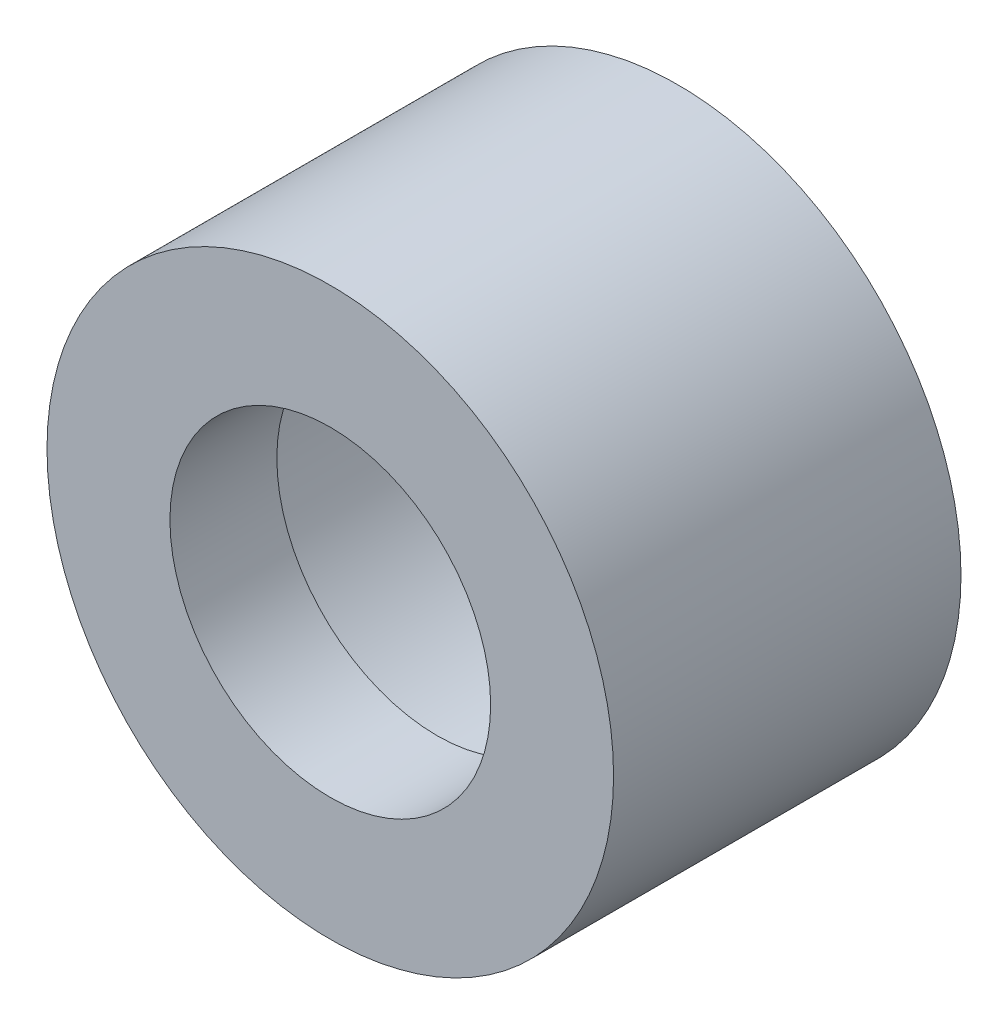
ISO-10303-21;
HEADER;
FILE_DESCRIPTION(('STEP AP214'),'2;1');
FILE_NAME('part.step','',(''),(''),'','','');
FILE_SCHEMA(('AUTOMOTIVE_DESIGN { 1 0 10303 214 1 1 1 1 }'));
ENDSEC;
DATA;
#1=APPLICATION_CONTEXT('core data for automotive mechanical design processes');
#2=APPLICATION_PROTOCOL_DEFINITION('international standard','automotive_design',2000,#1);
#3=PRODUCT_CONTEXT('',#1,'mechanical');
#4=PRODUCT('Part','Part','',(#3));
#5=PRODUCT_RELATED_PRODUCT_CATEGORY('part','',(#4));
#6=PRODUCT_DEFINITION_FORMATION('','',#4);
#7=PRODUCT_DEFINITION_CONTEXT('part definition',#1,'design');
#8=PRODUCT_DEFINITION('design','',#6,#7);
#9=PRODUCT_DEFINITION_SHAPE('','',#8);
#10=(LENGTH_UNIT() NAMED_UNIT(*) SI_UNIT(.MILLI.,.METRE.));
#11=(NAMED_UNIT(*) PLANE_ANGLE_UNIT() SI_UNIT($,.RADIAN.));
#12=(NAMED_UNIT(*) SI_UNIT($,.STERADIAN.) SOLID_ANGLE_UNIT());
#13=UNCERTAINTY_MEASURE_WITH_UNIT(LENGTH_MEASURE(1.E-05),#10,'distance_accuracy_value','');
#14=(GEOMETRIC_REPRESENTATION_CONTEXT(3) GLOBAL_UNCERTAINTY_ASSIGNED_CONTEXT((#13)) GLOBAL_UNIT_ASSIGNED_CONTEXT((#10,
#11,#12)) REPRESENTATION_CONTEXT('',''));
#15=CARTESIAN_POINT('',(0.,0.,0.));
#16=DIRECTION('',(0.,0.,1.));
#17=DIRECTION('',(1.,0.,0.));
#18=AXIS2_PLACEMENT_3D('',#15,#16,#17);
#19=CARTESIAN_POINT('',(0.,0.,16.51));
#20=DIRECTION('',(0.,0.,-1.));
#21=DIRECTION('',(-1.,0.,0.));
#22=AXIS2_PLACEMENT_3D('',#19,#20,#21);
#23=CYLINDRICAL_SURFACE('',#22,13.462);
#24=CARTESIAN_POINT('',(0.,0.,16.51));
#25=DIRECTION('',(0.,0.,1.));
#26=DIRECTION('',(1.,0.,0.));
#27=AXIS2_PLACEMENT_3D('',#24,#25,#26);
#28=CIRCLE('',#27,13.462);
#29=CARTESIAN_POINT('',(13.462,0.,16.51));
#30=VERTEX_POINT('',#29);
#31=EDGE_CURVE('E10',#30,#30,#28,.T.);
#32=ORIENTED_EDGE('',*,*,#31,.F.);
#33=EDGE_LOOP('',(#32));
#34=FACE_BOUND('',#33,.T.);
#35=CARTESIAN_POINT('',(0.,0.,0.));
#36=DIRECTION('',(0.,0.,1.));
#37=DIRECTION('',(1.,0.,0.));
#38=AXIS2_PLACEMENT_3D('',#35,#36,#37);
#39=CIRCLE('',#38,13.462);
#40=CARTESIAN_POINT('',(13.462,0.,0.));
#41=VERTEX_POINT('',#40);
#42=EDGE_CURVE('E40',#41,#41,#39,.T.);
#43=ORIENTED_EDGE('',*,*,#42,.T.);
#44=EDGE_LOOP('',(#43));
#45=FACE_BOUND('',#44,.T.);
#46=ADVANCED_FACE('F37',(#34,#45),#23,.T.);
#47=CARTESIAN_POINT('',(0.,0.,16.51));
#48=DIRECTION('',(0.,0.,1.));
#49=DIRECTION('',(1.,0.,0.));
#50=AXIS2_PLACEMENT_3D('',#47,#48,#49);
#51=PLANE('',#50);
#52=CARTESIAN_POINT('',(0.,0.,16.51));
#53=DIRECTION('',(0.,0.,1.));
#54=DIRECTION('',(1.,0.,0.));
#55=AXIS2_PLACEMENT_3D('',#52,#53,#54);
#56=CIRCLE('',#55,7.62);
#57=CARTESIAN_POINT('',(7.62,0.,16.51));
#58=VERTEX_POINT('',#57);
#59=EDGE_CURVE('E49',#58,#58,#56,.T.);
#60=ORIENTED_EDGE('',*,*,#59,.F.);
#61=EDGE_LOOP('',(#60));
#62=FACE_BOUND('',#61,.T.);
#63=ORIENTED_EDGE('',*,*,#31,.T.);
#64=EDGE_LOOP('',(#63));
#65=FACE_BOUND('',#64,.T.);
#66=ADVANCED_FACE('F78',(#62,#65),#51,.T.);
#67=CARTESIAN_POINT('',(0.,0.,0.));
#68=DIRECTION('',(0.,0.,1.));
#69=DIRECTION('',(1.,0.,0.));
#70=AXIS2_PLACEMENT_3D('',#67,#68,#69);
#71=PLANE('',#70);
#72=CARTESIAN_POINT('',(0.,0.,0.));
#73=DIRECTION('',(0.,0.,1.));
#74=DIRECTION('',(1.,0.,0.));
#75=AXIS2_PLACEMENT_3D('',#72,#73,#74);
#76=CIRCLE('',#75,10.414);
#77=CARTESIAN_POINT('',(10.414,0.,0.));
#78=VERTEX_POINT('',#77);
#79=EDGE_CURVE('E55',#78,#78,#76,.T.);
#80=ORIENTED_EDGE('',*,*,#79,.T.);
#81=EDGE_LOOP('',(#80));
#82=FACE_BOUND('',#81,.T.);
#83=ORIENTED_EDGE('',*,*,#42,.F.);
#84=EDGE_LOOP('',(#83));
#85=FACE_BOUND('',#84,.T.);
#86=ADVANCED_FACE('F74',(#82,#85),#71,.F.);
#87=CARTESIAN_POINT('',(0.,0.,16.51));
#88=DIRECTION('',(0.,0.,-1.));
#89=DIRECTION('',(-1.,0.,0.));
#90=AXIS2_PLACEMENT_3D('',#87,#88,#89);
#91=CYLINDRICAL_SURFACE('',#90,7.62);
#92=CARTESIAN_POINT('',(0.,0.,11.43));
#93=DIRECTION('',(0.,0.,1.));
#94=DIRECTION('',(1.,0.,0.));
#95=AXIS2_PLACEMENT_3D('',#92,#93,#94);
#96=CIRCLE('',#95,7.62);
#97=CARTESIAN_POINT('',(7.62,0.,11.43));
#98=VERTEX_POINT('',#97);
#99=EDGE_CURVE('E59',#98,#98,#96,.T.);
#100=ORIENTED_EDGE('',*,*,#99,.F.);
#101=EDGE_LOOP('',(#100));
#102=FACE_BOUND('',#101,.T.);
#103=ORIENTED_EDGE('',*,*,#59,.T.);
#104=EDGE_LOOP('',(#103));
#105=FACE_BOUND('',#104,.T.);
#106=ADVANCED_FACE('F70',(#102,#105),#91,.F.);
#107=CARTESIAN_POINT('',(0.,0.,11.43));
#108=DIRECTION('',(0.,0.,-1.));
#109=DIRECTION('',(-1.,0.,0.));
#110=AXIS2_PLACEMENT_3D('',#107,#108,#109);
#111=CYLINDRICAL_SURFACE('',#110,10.414);
#112=CARTESIAN_POINT('',(0.,0.,11.43));
#113=DIRECTION('',(0.,0.,1.));
#114=DIRECTION('',(1.,0.,0.));
#115=AXIS2_PLACEMENT_3D('',#112,#113,#114);
#116=CIRCLE('',#115,10.414);
#117=CARTESIAN_POINT('',(10.414,0.,11.43));
#118=VERTEX_POINT('',#117);
#119=EDGE_CURVE('E54',#118,#118,#116,.T.);
#120=ORIENTED_EDGE('',*,*,#119,.T.);
#121=EDGE_LOOP('',(#120));
#122=FACE_BOUND('',#121,.T.);
#123=ORIENTED_EDGE('',*,*,#79,.F.);
#124=EDGE_LOOP('',(#123));
#125=FACE_BOUND('',#124,.T.);
#126=ADVANCED_FACE('F73',(#122,#125),#111,.F.);
#127=CARTESIAN_POINT('',(0.,0.,11.43));
#128=DIRECTION('',(0.,0.,1.));
#129=DIRECTION('',(1.,0.,0.));
#130=AXIS2_PLACEMENT_3D('',#127,#128,#129);
#131=PLANE('',#130);
#132=ORIENTED_EDGE('',*,*,#99,.T.);
#133=EDGE_LOOP('',(#132));
#134=FACE_BOUND('',#133,.T.);
#135=ORIENTED_EDGE('',*,*,#119,.F.);
#136=EDGE_LOOP('',(#135));
#137=FACE_BOUND('',#136,.T.);
#138=ADVANCED_FACE('F67',(#134,#137),#131,.F.);
#139=CLOSED_SHELL('',(#46,#66,#86,#106,#126,#138));
#140=MANIFOLD_SOLID_BREP('B2',#139);
#141=ADVANCED_BREP_SHAPE_REPRESENTATION('',(#18,#140),#14);
#142=SHAPE_DEFINITION_REPRESENTATION(#9,#141);
ENDSEC;
END-ISO-10303-21;
